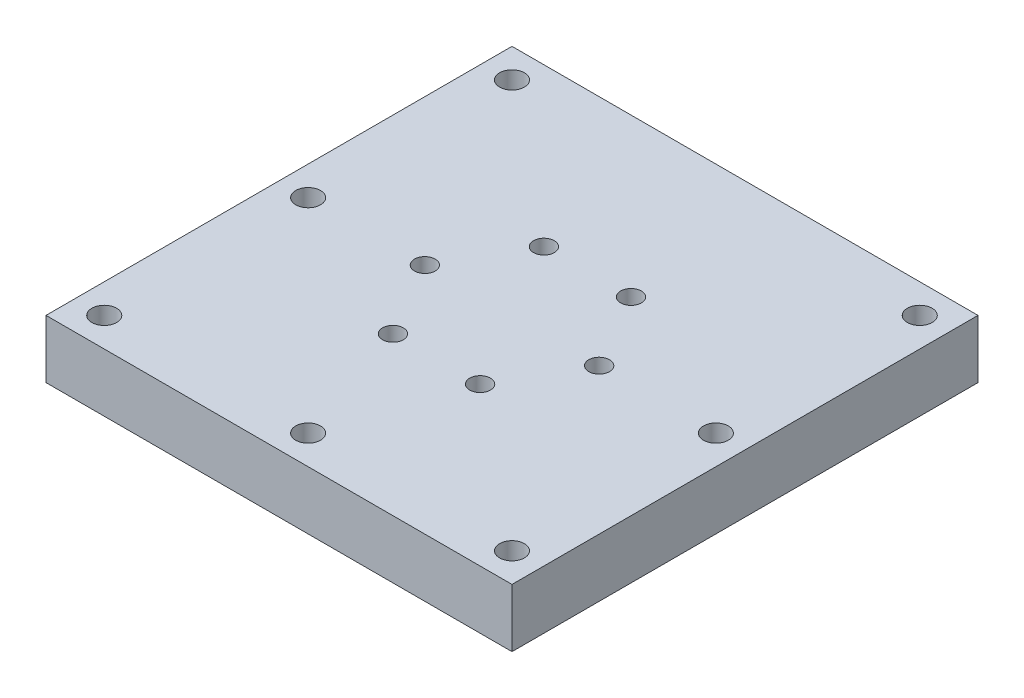
ISO-10303-21;
HEADER;
FILE_DESCRIPTION(('STEP AP214'),'2;1');
FILE_NAME('part.step','',(''),(''),'','','');
FILE_SCHEMA(('AUTOMOTIVE_DESIGN { 1 0 10303 214 1 1 1 1 }'));
ENDSEC;
DATA;
#1=APPLICATION_CONTEXT('core data for automotive mechanical design processes');
#2=APPLICATION_PROTOCOL_DEFINITION('international standard','automotive_design',2000,#1);
#3=PRODUCT_CONTEXT('',#1,'mechanical');
#4=PRODUCT('Part','Part','',(#3));
#5=PRODUCT_RELATED_PRODUCT_CATEGORY('part','',(#4));
#6=PRODUCT_DEFINITION_FORMATION('','',#4);
#7=PRODUCT_DEFINITION_CONTEXT('part definition',#1,'design');
#8=PRODUCT_DEFINITION('design','',#6,#7);
#9=PRODUCT_DEFINITION_SHAPE('','',#8);
#10=(LENGTH_UNIT() NAMED_UNIT(*) SI_UNIT(.MILLI.,.METRE.));
#11=(NAMED_UNIT(*) PLANE_ANGLE_UNIT() SI_UNIT($,.RADIAN.));
#12=(NAMED_UNIT(*) SI_UNIT($,.STERADIAN.) SOLID_ANGLE_UNIT());
#13=UNCERTAINTY_MEASURE_WITH_UNIT(LENGTH_MEASURE(1.E-05),#10,'distance_accuracy_value','');
#14=(GEOMETRIC_REPRESENTATION_CONTEXT(3) GLOBAL_UNCERTAINTY_ASSIGNED_CONTEXT((#13)) GLOBAL_UNIT_ASSIGNED_CONTEXT((#10,
#11,#12)) REPRESENTATION_CONTEXT('',''));
#15=CARTESIAN_POINT('',(0.,0.,0.));
#16=DIRECTION('',(0.,0.,1.));
#17=DIRECTION('',(1.,0.,0.));
#18=AXIS2_PLACEMENT_3D('',#15,#16,#17);
#19=CARTESIAN_POINT('',(0.,6.35,0.));
#20=DIRECTION('',(0.,-1.,0.));
#21=DIRECTION('',(0.,0.,-1.));
#22=AXIS2_PLACEMENT_3D('',#19,#20,#21);
#23=PLANE('',#22);
#24=CARTESIAN_POINT('',(-22.225,6.35,0.));
#25=DIRECTION('',(0.,1.,0.));
#26=DIRECTION('',(0.,0.,1.));
#27=AXIS2_PLACEMENT_3D('',#24,#25,#26);
#28=CIRCLE('',#27,1.35254999999999);
#29=CARTESIAN_POINT('',(-22.225,6.35,1.35254999999999));
#30=VERTEX_POINT('',#29);
#31=EDGE_CURVE('E361',#30,#30,#28,.T.);
#32=ORIENTED_EDGE('',*,*,#31,.F.);
#33=EDGE_LOOP('',(#32));
#34=FACE_BOUND('',#33,.T.);
#35=CARTESIAN_POINT('',(0.,6.35,22.225));
#36=DIRECTION('',(0.,1.,0.));
#37=DIRECTION('',(0.,0.,1.));
#38=AXIS2_PLACEMENT_3D('',#35,#36,#37);
#39=CIRCLE('',#38,1.35254999999999);
#40=CARTESIAN_POINT('',(0.,6.35,23.57755));
#41=VERTEX_POINT('',#40);
#42=EDGE_CURVE('E363',#41,#41,#39,.T.);
#43=ORIENTED_EDGE('',*,*,#42,.F.);
#44=EDGE_LOOP('',(#43));
#45=FACE_BOUND('',#44,.T.);
#46=CARTESIAN_POINT('',(22.225,6.35,22.225));
#47=DIRECTION('',(0.,1.,0.));
#48=DIRECTION('',(0.,0.,1.));
#49=AXIS2_PLACEMENT_3D('',#46,#47,#48);
#50=CIRCLE('',#49,1.35254999999999);
#51=CARTESIAN_POINT('',(22.225,6.35,23.57755));
#52=VERTEX_POINT('',#51);
#53=EDGE_CURVE('E381',#52,#52,#50,.T.);
#54=ORIENTED_EDGE('',*,*,#53,.F.);
#55=EDGE_LOOP('',(#54));
#56=FACE_BOUND('',#55,.T.);
#57=CARTESIAN_POINT('',(-22.225,6.35,-22.225));
#58=DIRECTION('',(0.,1.,0.));
#59=DIRECTION('',(0.,0.,1.));
#60=AXIS2_PLACEMENT_3D('',#57,#58,#59);
#61=CIRCLE('',#60,1.35254999999999);
#62=CARTESIAN_POINT('',(-22.225,6.35,-20.87245));
#63=VERTEX_POINT('',#62);
#64=EDGE_CURVE('E389',#63,#63,#61,.T.);
#65=ORIENTED_EDGE('',*,*,#64,.F.);
#66=EDGE_LOOP('',(#65));
#67=FACE_BOUND('',#66,.T.);
#68=CARTESIAN_POINT('',(-22.225,6.35,22.225));
#69=DIRECTION('',(0.,1.,0.));
#70=DIRECTION('',(0.,0.,1.));
#71=AXIS2_PLACEMENT_3D('',#68,#69,#70);
#72=CIRCLE('',#71,1.35254999999999);
#73=CARTESIAN_POINT('',(-22.225,6.35,23.57755));
#74=VERTEX_POINT('',#73);
#75=EDGE_CURVE('E395',#74,#74,#72,.T.);
#76=ORIENTED_EDGE('',*,*,#75,.F.);
#77=EDGE_LOOP('',(#76));
#78=FACE_BOUND('',#77,.T.);
#79=CARTESIAN_POINT('',(22.225,6.35,-22.225));
#80=DIRECTION('',(0.,1.,0.));
#81=DIRECTION('',(0.,0.,1.));
#82=AXIS2_PLACEMENT_3D('',#79,#80,#81);
#83=CIRCLE('',#82,1.35254999999999);
#84=CARTESIAN_POINT('',(22.225,6.35,-20.87245));
#85=VERTEX_POINT('',#84);
#86=EDGE_CURVE('E401',#85,#85,#83,.T.);
#87=ORIENTED_EDGE('',*,*,#86,.F.);
#88=EDGE_LOOP('',(#87));
#89=FACE_BOUND('',#88,.T.);
#90=CARTESIAN_POINT('',(4.74999999999993,6.35,8.22724133595221));
#91=DIRECTION('',(0.,1.,0.));
#92=DIRECTION('',(-0.866025403784436,0.,-0.500000000000004));
#93=AXIS2_PLACEMENT_3D('',#90,#91,#92);
#94=CIRCLE('',#93,1.13029999999999);
#95=CARTESIAN_POINT('',(3.77113148610239,6.35,7.66209133595221));
#96=VERTEX_POINT('',#95);
#97=EDGE_CURVE('E411',#96,#96,#94,.T.);
#98=ORIENTED_EDGE('',*,*,#97,.F.);
#99=EDGE_LOOP('',(#98));
#100=FACE_BOUND('',#99,.T.);
#101=CARTESIAN_POINT('',(-4.75000000000003,6.35,8.22724133595215));
#102=DIRECTION('',(0.,1.,0.));
#103=DIRECTION('',(0.,0.,-1.));
#104=AXIS2_PLACEMENT_3D('',#101,#102,#103);
#105=CIRCLE('',#104,1.13029999999999);
#106=CARTESIAN_POINT('',(-4.75000000000003,6.35,7.09694133595216));
#107=VERTEX_POINT('',#106);
#108=EDGE_CURVE('E412',#107,#107,#105,.T.);
#109=ORIENTED_EDGE('',*,*,#108,.F.);
#110=EDGE_LOOP('',(#109));
#111=FACE_BOUND('',#110,.T.);
#112=CARTESIAN_POINT('',(-9.5,6.35,-1.22298005056365E-13));
#113=DIRECTION('',(0.,1.,0.));
#114=DIRECTION('',(0.866025403784443,0.,-0.499999999999992));
#115=AXIS2_PLACEMENT_3D('',#112,#113,#114);
#116=CIRCLE('',#115,1.13029999999999);
#117=CARTESIAN_POINT('',(-8.52113148610245,6.35,-0.565150000000108));
#118=VERTEX_POINT('',#117);
#119=EDGE_CURVE('E419',#118,#118,#116,.T.);
#120=ORIENTED_EDGE('',*,*,#119,.F.);
#121=EDGE_LOOP('',(#120));
#122=FACE_BOUND('',#121,.T.);
#123=CARTESIAN_POINT('',(-4.74999999999987,6.35,-8.22724133595224));
#124=DIRECTION('',(0.,1.,0.));
#125=DIRECTION('',(0.866025403784433,0.,0.50000000000001));
#126=AXIS2_PLACEMENT_3D('',#123,#124,#125);
#127=CIRCLE('',#126,1.13029999999999);
#128=CARTESIAN_POINT('',(-3.77113148610234,6.35,-7.66209133595223));
#129=VERTEX_POINT('',#128);
#130=EDGE_CURVE('E425',#129,#129,#127,.T.);
#131=ORIENTED_EDGE('',*,*,#130,.F.);
#132=EDGE_LOOP('',(#131));
#133=FACE_BOUND('',#132,.T.);
#134=CARTESIAN_POINT('',(9.5,6.35,0.));
#135=DIRECTION('',(0.,1.,0.));
#136=DIRECTION('',(-0.86602540378444,0.,0.499999999999998));
#137=AXIS2_PLACEMENT_3D('',#134,#135,#136);
#138=CIRCLE('',#137,1.13029999999999);
#139=CARTESIAN_POINT('',(8.52113148610246,6.35,0.565150000000048));
#140=VERTEX_POINT('',#139);
#141=EDGE_CURVE('E434',#140,#140,#138,.T.);
#142=ORIENTED_EDGE('',*,*,#141,.F.);
#143=EDGE_LOOP('',(#142));
#144=FACE_BOUND('',#143,.T.);
#145=CARTESIAN_POINT('',(4.75000000000003,6.35,-8.22724133595215));
#146=DIRECTION('',(0.,1.,0.));
#147=DIRECTION('',(0.,0.,1.));
#148=AXIS2_PLACEMENT_3D('',#145,#146,#147);
#149=CIRCLE('',#148,1.13029999999999);
#150=CARTESIAN_POINT('',(4.75000000000003,6.35,-7.09694133595216));
#151=VERTEX_POINT('',#150);
#152=EDGE_CURVE('E437',#151,#151,#149,.T.);
#153=ORIENTED_EDGE('',*,*,#152,.F.);
#154=EDGE_LOOP('',(#153));
#155=FACE_BOUND('',#154,.T.);
#156=DIRECTION('',(-1.,0.,0.));
#157=VECTOR('',#156,1.);
#158=CARTESIAN_POINT('',(25.4,6.35,25.4));
#159=LINE('',#158,#157);
#160=CARTESIAN_POINT('',(25.4,6.35,25.4));
#161=VERTEX_POINT('',#160);
#162=CARTESIAN_POINT('',(-25.4,6.35,25.4));
#163=VERTEX_POINT('',#162);
#164=EDGE_CURVE('E100',#161,#163,#159,.T.);
#165=ORIENTED_EDGE('',*,*,#164,.F.);
#166=DIRECTION('',(0.,0.,-1.));
#167=VECTOR('',#166,1.);
#168=CARTESIAN_POINT('',(25.4,6.35,25.4));
#169=LINE('',#168,#167);
#170=CARTESIAN_POINT('',(25.4,6.35,-25.4));
#171=VERTEX_POINT('',#170);
#172=EDGE_CURVE('E90',#161,#171,#169,.T.);
#173=ORIENTED_EDGE('',*,*,#172,.T.);
#174=DIRECTION('',(-1.,0.,0.));
#175=VECTOR('',#174,1.);
#176=CARTESIAN_POINT('',(25.4,6.35,-25.4));
#177=LINE('',#176,#175);
#178=CARTESIAN_POINT('',(-25.4,6.35,-25.4));
#179=VERTEX_POINT('',#178);
#180=EDGE_CURVE('E85',#171,#179,#177,.T.);
#181=ORIENTED_EDGE('',*,*,#180,.T.);
#182=DIRECTION('',(0.,0.,-1.));
#183=VECTOR('',#182,1.);
#184=CARTESIAN_POINT('',(-25.4,6.35,25.4));
#185=LINE('',#184,#183);
#186=EDGE_CURVE('E89',#163,#179,#185,.T.);
#187=ORIENTED_EDGE('',*,*,#186,.F.);
#188=EDGE_LOOP('',(#165,#173,#181,#187));
#189=FACE_BOUND('',#188,.T.);
#190=CARTESIAN_POINT('',(22.225,6.35,0.));
#191=DIRECTION('',(0.,1.,0.));
#192=DIRECTION('',(0.,0.,1.));
#193=AXIS2_PLACEMENT_3D('',#190,#191,#192);
#194=CIRCLE('',#193,1.35254999999999);
#195=CARTESIAN_POINT('',(22.225,6.35,1.35254999999999));
#196=VERTEX_POINT('',#195);
#197=EDGE_CURVE('E371',#196,#196,#194,.T.);
#198=ORIENTED_EDGE('',*,*,#197,.F.);
#199=EDGE_LOOP('',(#198));
#200=FACE_BOUND('',#199,.T.);
#201=ADVANCED_FACE('F39',(#34,#45,#56,#67,#78,#89,#100,#111,#122,#133,#144,#155,#189,#200),#23,.F.);
#202=CARTESIAN_POINT('',(25.4,6.35,25.4));
#203=DIRECTION('',(0.,0.,1.));
#204=DIRECTION('',(1.,0.,0.));
#205=AXIS2_PLACEMENT_3D('',#202,#203,#204);
#206=PLANE('',#205);
#207=DIRECTION('',(-1.,0.,0.));
#208=VECTOR('',#207,1.);
#209=CARTESIAN_POINT('',(25.4,0.,25.4));
#210=LINE('',#209,#208);
#211=CARTESIAN_POINT('',(25.4,0.,25.4));
#212=VERTEX_POINT('',#211);
#213=CARTESIAN_POINT('',(-25.4,0.,25.4));
#214=VERTEX_POINT('',#213);
#215=EDGE_CURVE('E106',#212,#214,#210,.T.);
#216=ORIENTED_EDGE('',*,*,#215,.F.);
#217=DIRECTION('',(0.,-1.,0.));
#218=VECTOR('',#217,1.);
#219=CARTESIAN_POINT('',(25.4,6.35,25.4));
#220=LINE('',#219,#218);
#221=EDGE_CURVE('E11',#161,#212,#220,.T.);
#222=ORIENTED_EDGE('',*,*,#221,.F.);
#223=ORIENTED_EDGE('',*,*,#164,.T.);
#224=DIRECTION('',(0.,-1.,0.));
#225=VECTOR('',#224,1.);
#226=CARTESIAN_POINT('',(-25.4,6.35,25.4));
#227=LINE('',#226,#225);
#228=EDGE_CURVE('E43',#163,#214,#227,.T.);
#229=ORIENTED_EDGE('',*,*,#228,.T.);
#230=EDGE_LOOP('',(#216,#222,#223,#229));
#231=FACE_BOUND('',#230,.T.);
#232=ADVANCED_FACE('F41',(#231),#206,.T.);
#233=CARTESIAN_POINT('',(25.4,6.35,25.4));
#234=DIRECTION('',(-1.,0.,0.));
#235=DIRECTION('',(0.,0.,1.));
#236=AXIS2_PLACEMENT_3D('',#233,#234,#235);
#237=PLANE('',#236);
#238=DIRECTION('',(0.,0.,-1.));
#239=VECTOR('',#238,1.);
#240=CARTESIAN_POINT('',(25.4,0.,25.4));
#241=LINE('',#240,#239);
#242=CARTESIAN_POINT('',(25.4,0.,-25.4));
#243=VERTEX_POINT('',#242);
#244=EDGE_CURVE('E73',#212,#243,#241,.T.);
#245=ORIENTED_EDGE('',*,*,#244,.T.);
#246=DIRECTION('',(0.,-1.,0.));
#247=VECTOR('',#246,1.);
#248=CARTESIAN_POINT('',(25.4,6.35,-25.4));
#249=LINE('',#248,#247);
#250=EDGE_CURVE('E49',#171,#243,#249,.T.);
#251=ORIENTED_EDGE('',*,*,#250,.F.);
#252=ORIENTED_EDGE('',*,*,#172,.F.);
#253=ORIENTED_EDGE('',*,*,#221,.T.);
#254=EDGE_LOOP('',(#245,#251,#252,#253));
#255=FACE_BOUND('',#254,.T.);
#256=ADVANCED_FACE('F117',(#255),#237,.F.);
#257=CARTESIAN_POINT('',(25.4,6.35,-25.4));
#258=DIRECTION('',(0.,0.,1.));
#259=DIRECTION('',(1.,0.,0.));
#260=AXIS2_PLACEMENT_3D('',#257,#258,#259);
#261=PLANE('',#260);
#262=CARTESIAN_POINT('',(0.,3.175,-25.4));
#263=DIRECTION('',(0.,0.,-1.));
#264=DIRECTION('',(-1.,0.,0.));
#265=AXIS2_PLACEMENT_3D('',#262,#263,#264);
#266=CIRCLE('',#265,2.38125);
#267=CARTESIAN_POINT('',(-2.38125,3.175,-25.4));
#268=VERTEX_POINT('',#267);
#269=EDGE_CURVE('E377',#268,#268,#266,.T.);
#270=ORIENTED_EDGE('',*,*,#269,.F.);
#271=EDGE_LOOP('',(#270));
#272=FACE_BOUND('',#271,.T.);
#273=DIRECTION('',(-1.,0.,0.));
#274=VECTOR('',#273,1.);
#275=CARTESIAN_POINT('',(25.4,0.,-25.4));
#276=LINE('',#275,#274);
#277=CARTESIAN_POINT('',(-25.4,0.,-25.4));
#278=VERTEX_POINT('',#277);
#279=EDGE_CURVE('E97',#243,#278,#276,.T.);
#280=ORIENTED_EDGE('',*,*,#279,.T.);
#281=DIRECTION('',(0.,-1.,0.));
#282=VECTOR('',#281,1.);
#283=CARTESIAN_POINT('',(-25.4,6.35,-25.4));
#284=LINE('',#283,#282);
#285=EDGE_CURVE('E94',#179,#278,#284,.T.);
#286=ORIENTED_EDGE('',*,*,#285,.F.);
#287=ORIENTED_EDGE('',*,*,#180,.F.);
#288=ORIENTED_EDGE('',*,*,#250,.T.);
#289=EDGE_LOOP('',(#280,#286,#287,#288));
#290=FACE_BOUND('',#289,.T.);
#291=ADVANCED_FACE('F95',(#272,#290),#261,.F.);
#292=CARTESIAN_POINT('',(-25.4,6.35,25.4));
#293=DIRECTION('',(-1.,0.,0.));
#294=DIRECTION('',(0.,0.,1.));
#295=AXIS2_PLACEMENT_3D('',#292,#293,#294);
#296=PLANE('',#295);
#297=DIRECTION('',(0.,0.,-1.));
#298=VECTOR('',#297,1.);
#299=CARTESIAN_POINT('',(-25.4,0.,25.4));
#300=LINE('',#299,#298);
#301=EDGE_CURVE('E109',#214,#278,#300,.T.);
#302=ORIENTED_EDGE('',*,*,#301,.F.);
#303=ORIENTED_EDGE('',*,*,#228,.F.);
#304=ORIENTED_EDGE('',*,*,#186,.T.);
#305=ORIENTED_EDGE('',*,*,#285,.T.);
#306=EDGE_LOOP('',(#302,#303,#304,#305));
#307=FACE_BOUND('',#306,.T.);
#308=ADVANCED_FACE('F99',(#307),#296,.T.);
#309=CARTESIAN_POINT('',(0.,0.,0.));
#310=DIRECTION('',(0.,-1.,0.));
#311=DIRECTION('',(0.,0.,-1.));
#312=AXIS2_PLACEMENT_3D('',#309,#310,#311);
#313=PLANE('',#312);
#314=CARTESIAN_POINT('',(-22.225,0.,0.));
#315=DIRECTION('',(0.,1.,0.));
#316=DIRECTION('',(0.,0.,1.));
#317=AXIS2_PLACEMENT_3D('',#314,#315,#316);
#318=CIRCLE('',#317,1.35255);
#319=CARTESIAN_POINT('',(-22.225,0.,1.35255));
#320=VERTEX_POINT('',#319);
#321=EDGE_CURVE('E359',#320,#320,#318,.T.);
#322=ORIENTED_EDGE('',*,*,#321,.T.);
#323=EDGE_LOOP('',(#322));
#324=FACE_BOUND('',#323,.T.);
#325=CARTESIAN_POINT('',(0.,0.,22.225));
#326=DIRECTION('',(0.,1.,0.));
#327=DIRECTION('',(0.,0.,1.));
#328=AXIS2_PLACEMENT_3D('',#325,#326,#327);
#329=CIRCLE('',#328,1.35255);
#330=CARTESIAN_POINT('',(0.,0.,23.57755));
#331=VERTEX_POINT('',#330);
#332=EDGE_CURVE('E368',#331,#331,#329,.T.);
#333=ORIENTED_EDGE('',*,*,#332,.T.);
#334=EDGE_LOOP('',(#333));
#335=FACE_BOUND('',#334,.T.);
#336=CARTESIAN_POINT('',(22.225,0.,0.));
#337=DIRECTION('',(0.,1.,0.));
#338=DIRECTION('',(0.,0.,1.));
#339=AXIS2_PLACEMENT_3D('',#336,#337,#338);
#340=CIRCLE('',#339,1.35255);
#341=CARTESIAN_POINT('',(22.225,0.,1.35255));
#342=VERTEX_POINT('',#341);
#343=EDGE_CURVE('E374',#342,#342,#340,.T.);
#344=ORIENTED_EDGE('',*,*,#343,.T.);
#345=EDGE_LOOP('',(#344));
#346=FACE_BOUND('',#345,.T.);
#347=CARTESIAN_POINT('',(22.225,0.,22.225));
#348=DIRECTION('',(0.,1.,0.));
#349=DIRECTION('',(0.,0.,1.));
#350=AXIS2_PLACEMENT_3D('',#347,#348,#349);
#351=CIRCLE('',#350,1.35255);
#352=CARTESIAN_POINT('',(22.225,0.,23.57755));
#353=VERTEX_POINT('',#352);
#354=EDGE_CURVE('E386',#353,#353,#351,.T.);
#355=ORIENTED_EDGE('',*,*,#354,.T.);
#356=EDGE_LOOP('',(#355));
#357=FACE_BOUND('',#356,.T.);
#358=CARTESIAN_POINT('',(-22.225,0.,-22.225));
#359=DIRECTION('',(0.,1.,0.));
#360=DIRECTION('',(0.,0.,1.));
#361=AXIS2_PLACEMENT_3D('',#358,#359,#360);
#362=CIRCLE('',#361,1.35255);
#363=CARTESIAN_POINT('',(-22.225,0.,-20.87245));
#364=VERTEX_POINT('',#363);
#365=EDGE_CURVE('E392',#364,#364,#362,.T.);
#366=ORIENTED_EDGE('',*,*,#365,.T.);
#367=EDGE_LOOP('',(#366));
#368=FACE_BOUND('',#367,.T.);
#369=CARTESIAN_POINT('',(-22.225,0.,22.225));
#370=DIRECTION('',(0.,1.,0.));
#371=DIRECTION('',(0.,0.,1.));
#372=AXIS2_PLACEMENT_3D('',#369,#370,#371);
#373=CIRCLE('',#372,1.35255);
#374=CARTESIAN_POINT('',(-22.225,0.,23.57755));
#375=VERTEX_POINT('',#374);
#376=EDGE_CURVE('E398',#375,#375,#373,.T.);
#377=ORIENTED_EDGE('',*,*,#376,.T.);
#378=EDGE_LOOP('',(#377));
#379=FACE_BOUND('',#378,.T.);
#380=CARTESIAN_POINT('',(22.225,0.,-22.225));
#381=DIRECTION('',(0.,1.,0.));
#382=DIRECTION('',(0.,0.,1.));
#383=AXIS2_PLACEMENT_3D('',#380,#381,#382);
#384=CIRCLE('',#383,1.35255);
#385=CARTESIAN_POINT('',(22.225,0.,-20.87245));
#386=VERTEX_POINT('',#385);
#387=EDGE_CURVE('E404',#386,#386,#384,.T.);
#388=ORIENTED_EDGE('',*,*,#387,.T.);
#389=EDGE_LOOP('',(#388));
#390=FACE_BOUND('',#389,.T.);
#391=CARTESIAN_POINT('',(4.74999999999993,0.,8.22724133595221));
#392=DIRECTION('',(0.,-1.,0.));
#393=DIRECTION('',(0.866025403784436,0.,0.500000000000004));
#394=AXIS2_PLACEMENT_3D('',#391,#392,#393);
#395=CIRCLE('',#394,1.13029999999999);
#396=CARTESIAN_POINT('',(5.72886851389747,0.,8.79239133595221));
#397=VERTEX_POINT('',#396);
#398=EDGE_CURVE('E408',#397,#397,#395,.T.);
#399=ORIENTED_EDGE('',*,*,#398,.F.);
#400=EDGE_LOOP('',(#399));
#401=FACE_BOUND('',#400,.T.);
#402=CARTESIAN_POINT('',(-4.75000000000003,0.,8.22724133595215));
#403=DIRECTION('',(0.,-1.,0.));
#404=DIRECTION('',(0.,0.,1.));
#405=AXIS2_PLACEMENT_3D('',#402,#403,#404);
#406=CIRCLE('',#405,1.13029999999999);
#407=CARTESIAN_POINT('',(-4.75000000000003,0.,9.35754133595214));
#408=VERTEX_POINT('',#407);
#409=EDGE_CURVE('E416',#408,#408,#406,.T.);
#410=ORIENTED_EDGE('',*,*,#409,.F.);
#411=EDGE_LOOP('',(#410));
#412=FACE_BOUND('',#411,.T.);
#413=CARTESIAN_POINT('',(-9.5,0.,-1.22298005056365E-13));
#414=DIRECTION('',(0.,-1.,0.));
#415=DIRECTION('',(-0.866025403784443,0.,0.499999999999992));
#416=AXIS2_PLACEMENT_3D('',#413,#414,#415);
#417=CIRCLE('',#416,1.13029999999999);
#418=CARTESIAN_POINT('',(-10.4788685138975,0.,0.565149999999863));
#419=VERTEX_POINT('',#418);
#420=EDGE_CURVE('E422',#419,#419,#417,.T.);
#421=ORIENTED_EDGE('',*,*,#420,.F.);
#422=EDGE_LOOP('',(#421));
#423=FACE_BOUND('',#422,.T.);
#424=CARTESIAN_POINT('',(-4.74999999999987,0.,-8.22724133595224));
#425=DIRECTION('',(0.,-1.,0.));
#426=DIRECTION('',(-0.866025403784433,0.,-0.50000000000001));
#427=AXIS2_PLACEMENT_3D('',#424,#425,#426);
#428=CIRCLE('',#427,1.13029999999999);
#429=CARTESIAN_POINT('',(-5.72886851389741,0.,-8.79239133595225));
#430=VERTEX_POINT('',#429);
#431=EDGE_CURVE('E407',#430,#430,#428,.T.);
#432=ORIENTED_EDGE('',*,*,#431,.F.);
#433=EDGE_LOOP('',(#432));
#434=FACE_BOUND('',#433,.T.);
#435=CARTESIAN_POINT('',(9.5,0.,0.));
#436=DIRECTION('',(0.,-1.,0.));
#437=DIRECTION('',(0.86602540378444,0.,-0.499999999999998));
#438=AXIS2_PLACEMENT_3D('',#435,#436,#437);
#439=CIRCLE('',#438,1.13029999999999);
#440=CARTESIAN_POINT('',(10.4788685138975,0.,-0.565149999999935));
#441=VERTEX_POINT('',#440);
#442=EDGE_CURVE('E415',#441,#441,#439,.T.);
#443=ORIENTED_EDGE('',*,*,#442,.F.);
#444=EDGE_LOOP('',(#443));
#445=FACE_BOUND('',#444,.T.);
#446=CARTESIAN_POINT('',(4.75000000000003,0.,-8.22724133595215));
#447=DIRECTION('',(0.,-1.,0.));
#448=DIRECTION('',(0.,0.,-1.));
#449=AXIS2_PLACEMENT_3D('',#446,#447,#448);
#450=CIRCLE('',#449,1.13029999999999);
#451=CARTESIAN_POINT('',(4.75000000000003,0.,-9.35754133595214));
#452=VERTEX_POINT('',#451);
#453=EDGE_CURVE('E110',#452,#452,#450,.T.);
#454=ORIENTED_EDGE('',*,*,#453,.F.);
#455=EDGE_LOOP('',(#454));
#456=FACE_BOUND('',#455,.T.);
#457=ORIENTED_EDGE('',*,*,#215,.T.);
#458=ORIENTED_EDGE('',*,*,#301,.T.);
#459=ORIENTED_EDGE('',*,*,#279,.F.);
#460=ORIENTED_EDGE('',*,*,#244,.F.);
#461=EDGE_LOOP('',(#457,#458,#459,#460));
#462=FACE_BOUND('',#461,.T.);
#463=ADVANCED_FACE('F115',(#324,#335,#346,#357,#368,#379,#390,#401,#412,#423,#434,#445,#456,
#462),#313,.T.);
#464=CARTESIAN_POINT('',(4.75000000000003,6.35,-8.22724133595215));
#465=DIRECTION('',(0.,1.,0.));
#466=DIRECTION('',(0.,0.,1.));
#467=AXIS2_PLACEMENT_3D('',#464,#465,#466);
#468=CYLINDRICAL_SURFACE('',#467,1.13029999999999);
#469=ORIENTED_EDGE('',*,*,#453,.T.);
#470=EDGE_LOOP('',(#469));
#471=FACE_BOUND('',#470,.T.);
#472=ORIENTED_EDGE('',*,*,#152,.T.);
#473=EDGE_LOOP('',(#472));
#474=FACE_BOUND('',#473,.T.);
#475=ADVANCED_FACE('F131',(#471,#474),#468,.F.);
#476=CARTESIAN_POINT('',(9.5,6.35,0.));
#477=DIRECTION('',(0.,1.,0.));
#478=DIRECTION('',(-0.86602540378444,0.,0.499999999999998));
#479=AXIS2_PLACEMENT_3D('',#476,#477,#478);
#480=CYLINDRICAL_SURFACE('',#479,1.13029999999999);
#481=ORIENTED_EDGE('',*,*,#442,.T.);
#482=EDGE_LOOP('',(#481));
#483=FACE_BOUND('',#482,.T.);
#484=ORIENTED_EDGE('',*,*,#141,.T.);
#485=EDGE_LOOP('',(#484));
#486=FACE_BOUND('',#485,.T.);
#487=ADVANCED_FACE('F156',(#483,#486),#480,.F.);
#488=CARTESIAN_POINT('',(-4.74999999999987,6.35,-8.22724133595224));
#489=DIRECTION('',(0.,1.,0.));
#490=DIRECTION('',(0.866025403784433,0.,0.50000000000001));
#491=AXIS2_PLACEMENT_3D('',#488,#489,#490);
#492=CYLINDRICAL_SURFACE('',#491,1.13029999999999);
#493=ORIENTED_EDGE('',*,*,#431,.T.);
#494=EDGE_LOOP('',(#493));
#495=FACE_BOUND('',#494,.T.);
#496=ORIENTED_EDGE('',*,*,#130,.T.);
#497=EDGE_LOOP('',(#496));
#498=FACE_BOUND('',#497,.T.);
#499=ADVANCED_FACE('F164',(#495,#498),#492,.F.);
#500=CARTESIAN_POINT('',(-9.5,6.35,-1.22298005056365E-13));
#501=DIRECTION('',(0.,1.,0.));
#502=DIRECTION('',(0.866025403784443,0.,-0.499999999999992));
#503=AXIS2_PLACEMENT_3D('',#500,#501,#502);
#504=CYLINDRICAL_SURFACE('',#503,1.13029999999999);
#505=ORIENTED_EDGE('',*,*,#420,.T.);
#506=EDGE_LOOP('',(#505));
#507=FACE_BOUND('',#506,.T.);
#508=ORIENTED_EDGE('',*,*,#119,.T.);
#509=EDGE_LOOP('',(#508));
#510=FACE_BOUND('',#509,.T.);
#511=ADVANCED_FACE('F172',(#507,#510),#504,.F.);
#512=CARTESIAN_POINT('',(-4.75000000000003,6.35,8.22724133595215));
#513=DIRECTION('',(0.,1.,0.));
#514=DIRECTION('',(0.,0.,-1.));
#515=AXIS2_PLACEMENT_3D('',#512,#513,#514);
#516=CYLINDRICAL_SURFACE('',#515,1.13029999999999);
#517=ORIENTED_EDGE('',*,*,#409,.T.);
#518=EDGE_LOOP('',(#517));
#519=FACE_BOUND('',#518,.T.);
#520=ORIENTED_EDGE('',*,*,#108,.T.);
#521=EDGE_LOOP('',(#520));
#522=FACE_BOUND('',#521,.T.);
#523=ADVANCED_FACE('F181',(#519,#522),#516,.F.);
#524=CARTESIAN_POINT('',(4.74999999999993,6.35,8.22724133595221));
#525=DIRECTION('',(0.,1.,0.));
#526=DIRECTION('',(-0.866025403784436,0.,-0.500000000000004));
#527=AXIS2_PLACEMENT_3D('',#524,#525,#526);
#528=CYLINDRICAL_SURFACE('',#527,1.13029999999999);
#529=ORIENTED_EDGE('',*,*,#398,.T.);
#530=EDGE_LOOP('',(#529));
#531=FACE_BOUND('',#530,.T.);
#532=ORIENTED_EDGE('',*,*,#97,.T.);
#533=EDGE_LOOP('',(#532));
#534=FACE_BOUND('',#533,.T.);
#535=ADVANCED_FACE('F189',(#531,#534),#528,.F.);
#536=CARTESIAN_POINT('',(22.225,6.35,-22.225));
#537=DIRECTION('',(0.,1.,0.));
#538=DIRECTION('',(0.,0.,1.));
#539=AXIS2_PLACEMENT_3D('',#536,#537,#538);
#540=CYLINDRICAL_SURFACE('',#539,1.35254999999999);
#541=ORIENTED_EDGE('',*,*,#387,.F.);
#542=EDGE_LOOP('',(#541));
#543=FACE_BOUND('',#542,.T.);
#544=ORIENTED_EDGE('',*,*,#86,.T.);
#545=EDGE_LOOP('',(#544));
#546=FACE_BOUND('',#545,.T.);
#547=ADVANCED_FACE('F196',(#543,#546),#540,.F.);
#548=CARTESIAN_POINT('',(-22.225,6.35,22.225));
#549=DIRECTION('',(0.,1.,0.));
#550=DIRECTION('',(0.,0.,1.));
#551=AXIS2_PLACEMENT_3D('',#548,#549,#550);
#552=CYLINDRICAL_SURFACE('',#551,1.35254999999999);
#553=ORIENTED_EDGE('',*,*,#376,.F.);
#554=EDGE_LOOP('',(#553));
#555=FACE_BOUND('',#554,.T.);
#556=ORIENTED_EDGE('',*,*,#75,.T.);
#557=EDGE_LOOP('',(#556));
#558=FACE_BOUND('',#557,.T.);
#559=ADVANCED_FACE('F203',(#555,#558),#552,.F.);
#560=CARTESIAN_POINT('',(-22.225,6.35,-22.225));
#561=DIRECTION('',(0.,1.,0.));
#562=DIRECTION('',(0.,0.,1.));
#563=AXIS2_PLACEMENT_3D('',#560,#561,#562);
#564=CYLINDRICAL_SURFACE('',#563,1.35254999999999);
#565=ORIENTED_EDGE('',*,*,#365,.F.);
#566=EDGE_LOOP('',(#565));
#567=FACE_BOUND('',#566,.T.);
#568=ORIENTED_EDGE('',*,*,#64,.T.);
#569=EDGE_LOOP('',(#568));
#570=FACE_BOUND('',#569,.T.);
#571=ADVANCED_FACE('F211',(#567,#570),#564,.F.);
#572=CARTESIAN_POINT('',(22.225,6.35,22.225));
#573=DIRECTION('',(0.,1.,0.));
#574=DIRECTION('',(0.,0.,1.));
#575=AXIS2_PLACEMENT_3D('',#572,#573,#574);
#576=CYLINDRICAL_SURFACE('',#575,1.35254999999999);
#577=ORIENTED_EDGE('',*,*,#354,.F.);
#578=EDGE_LOOP('',(#577));
#579=FACE_BOUND('',#578,.T.);
#580=ORIENTED_EDGE('',*,*,#53,.T.);
#581=EDGE_LOOP('',(#580));
#582=FACE_BOUND('',#581,.T.);
#583=ADVANCED_FACE('F219',(#579,#582),#576,.F.);
#584=CARTESIAN_POINT('',(0.,3.175,-3.175));
#585=DIRECTION('',(0.,0.,-1.));
#586=DIRECTION('',(-1.,0.,0.));
#587=AXIS2_PLACEMENT_3D('',#584,#585,#586);
#588=CYLINDRICAL_SURFACE('',#587,2.38125);
#589=CARTESIAN_POINT('',(0.,3.175,-3.175));
#590=DIRECTION('',(0.,0.,-1.));
#591=DIRECTION('',(-1.,0.,0.));
#592=AXIS2_PLACEMENT_3D('',#589,#590,#591);
#593=CIRCLE('',#592,2.38125);
#594=CARTESIAN_POINT('',(-2.38125,3.175,-3.175));
#595=VERTEX_POINT('',#594);
#596=EDGE_CURVE('E378',#595,#595,#593,.T.);
#597=ORIENTED_EDGE('',*,*,#596,.F.);
#598=EDGE_LOOP('',(#597));
#599=FACE_BOUND('',#598,.T.);
#600=ORIENTED_EDGE('',*,*,#269,.T.);
#601=EDGE_LOOP('',(#600));
#602=FACE_BOUND('',#601,.T.);
#603=ADVANCED_FACE('F227',(#599,#602),#588,.F.);
#604=CARTESIAN_POINT('',(0.,3.175,-3.175));
#605=DIRECTION('',(0.,0.,-1.));
#606=DIRECTION('',(-1.,0.,0.));
#607=AXIS2_PLACEMENT_3D('',#604,#605,#606);
#608=PLANE('',#607);
#609=ORIENTED_EDGE('',*,*,#596,.T.);
#610=EDGE_LOOP('',(#609));
#611=FACE_BOUND('',#610,.T.);
#612=ADVANCED_FACE('F236',(#611),#608,.T.);
#613=CARTESIAN_POINT('',(22.225,6.35,0.));
#614=DIRECTION('',(0.,1.,0.));
#615=DIRECTION('',(0.,0.,1.));
#616=AXIS2_PLACEMENT_3D('',#613,#614,#615);
#617=CYLINDRICAL_SURFACE('',#616,1.35254999999999);
#618=ORIENTED_EDGE('',*,*,#343,.F.);
#619=EDGE_LOOP('',(#618));
#620=FACE_BOUND('',#619,.T.);
#621=ORIENTED_EDGE('',*,*,#197,.T.);
#622=EDGE_LOOP('',(#621));
#623=FACE_BOUND('',#622,.T.);
#624=ADVANCED_FACE('F244',(#620,#623),#617,.F.);
#625=CARTESIAN_POINT('',(0.,6.35,22.225));
#626=DIRECTION('',(0.,1.,0.));
#627=DIRECTION('',(0.,0.,1.));
#628=AXIS2_PLACEMENT_3D('',#625,#626,#627);
#629=CYLINDRICAL_SURFACE('',#628,1.35254999999999);
#630=ORIENTED_EDGE('',*,*,#332,.F.);
#631=EDGE_LOOP('',(#630));
#632=FACE_BOUND('',#631,.T.);
#633=ORIENTED_EDGE('',*,*,#42,.T.);
#634=EDGE_LOOP('',(#633));
#635=FACE_BOUND('',#634,.T.);
#636=ADVANCED_FACE('F252',(#632,#635),#629,.F.);
#637=CARTESIAN_POINT('',(-22.225,6.35,0.));
#638=DIRECTION('',(0.,1.,0.));
#639=DIRECTION('',(0.,0.,1.));
#640=AXIS2_PLACEMENT_3D('',#637,#638,#639);
#641=CYLINDRICAL_SURFACE('',#640,1.35254999999999);
#642=ORIENTED_EDGE('',*,*,#321,.F.);
#643=EDGE_LOOP('',(#642));
#644=FACE_BOUND('',#643,.T.);
#645=ORIENTED_EDGE('',*,*,#31,.T.);
#646=EDGE_LOOP('',(#645));
#647=FACE_BOUND('',#646,.T.);
#648=ADVANCED_FACE('F259',(#644,#647),#641,.F.);
#649=CLOSED_SHELL('',(#201,#232,#256,#291,#308,#463,#475,#487,#499,#511,#523,#535,#547,#559,
#571,#583,#603,#612,#624,#636,#648));
#650=MANIFOLD_SOLID_BREP('B2',#649);
#651=ADVANCED_BREP_SHAPE_REPRESENTATION('',(#18,#650),#14);
#652=SHAPE_DEFINITION_REPRESENTATION(#9,#651);
ENDSEC;
END-ISO-10303-21;
